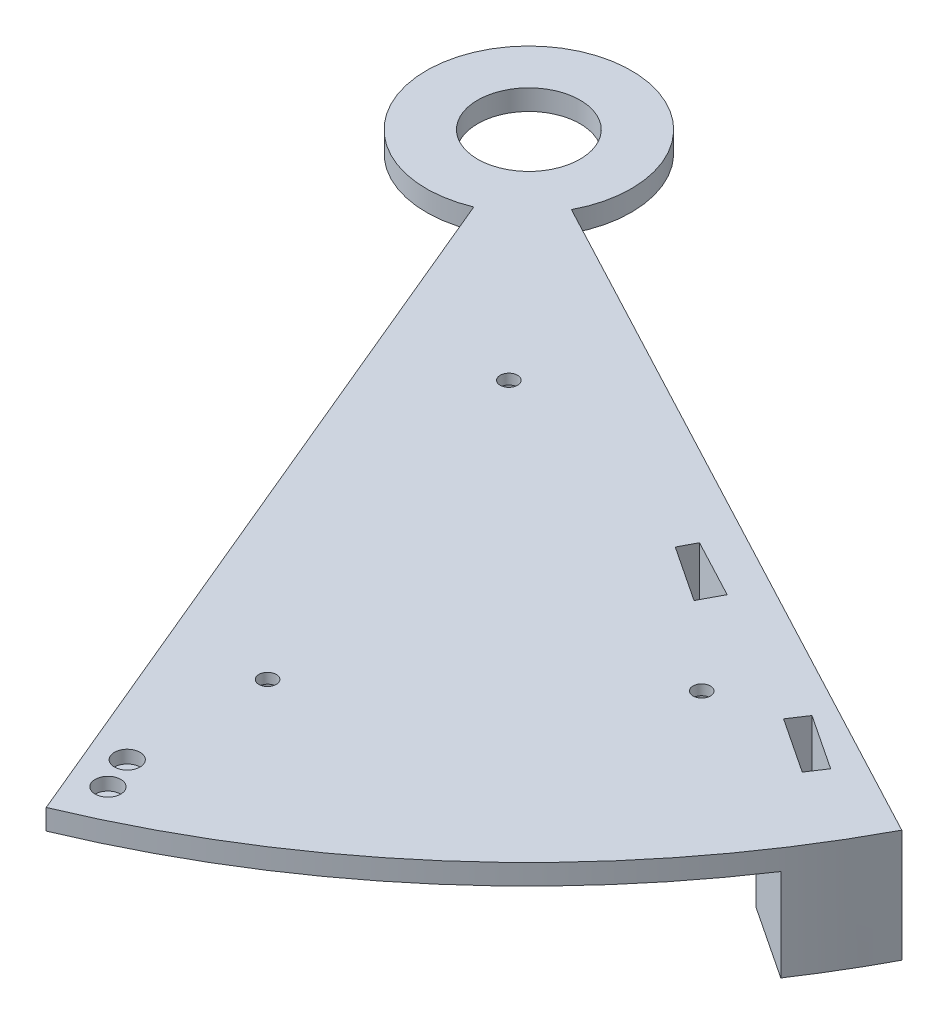
ISO-10303-21;
HEADER;
FILE_DESCRIPTION(('STEP AP214'),'2;1');
FILE_NAME('part.step','',(''),(''),'','','');
FILE_SCHEMA(('AUTOMOTIVE_DESIGN { 1 0 10303 214 1 1 1 1 }'));
ENDSEC;
DATA;
#1=APPLICATION_CONTEXT('core data for automotive mechanical design processes');
#2=APPLICATION_PROTOCOL_DEFINITION('international standard','automotive_design',2000,#1);
#3=PRODUCT_CONTEXT('',#1,'mechanical');
#4=PRODUCT('Part','Part','',(#3));
#5=PRODUCT_RELATED_PRODUCT_CATEGORY('part','',(#4));
#6=PRODUCT_DEFINITION_FORMATION('','',#4);
#7=PRODUCT_DEFINITION_CONTEXT('part definition',#1,'design');
#8=PRODUCT_DEFINITION('design','',#6,#7);
#9=PRODUCT_DEFINITION_SHAPE('','',#8);
#10=(LENGTH_UNIT() NAMED_UNIT(*) SI_UNIT(.MILLI.,.METRE.));
#11=(NAMED_UNIT(*) PLANE_ANGLE_UNIT() SI_UNIT($,.RADIAN.));
#12=(NAMED_UNIT(*) SI_UNIT($,.STERADIAN.) SOLID_ANGLE_UNIT());
#13=UNCERTAINTY_MEASURE_WITH_UNIT(LENGTH_MEASURE(1.E-05),#10,'distance_accuracy_value','');
#14=(GEOMETRIC_REPRESENTATION_CONTEXT(3) GLOBAL_UNCERTAINTY_ASSIGNED_CONTEXT((#13)) GLOBAL_UNIT_ASSIGNED_CONTEXT((#10,
#11,#12)) REPRESENTATION_CONTEXT('',''));
#15=CARTESIAN_POINT('',(0.,0.,0.));
#16=DIRECTION('',(0.,0.,1.));
#17=DIRECTION('',(1.,0.,0.));
#18=AXIS2_PLACEMENT_3D('',#15,#16,#17);
#19=CARTESIAN_POINT('',(0.,-18.,0.));
#20=DIRECTION('',(0.,-1.,0.));
#21=DIRECTION('',(0.,0.,-1.));
#22=AXIS2_PLACEMENT_3D('',#19,#20,#21);
#23=PLANE('',#22);
#24=DIRECTION('',(0.833392984477162,0.,0.552680860374456));
#25=VECTOR('',#24,1.);
#26=CARTESIAN_POINT('',(5.80314903393188,-18.,-8.75062633701035));
#27=LINE('',#26,#25);
#28=CARTESIAN_POINT('',(126.70883079196,-18.,71.4303416610689));
#29=VERTEX_POINT('',#28);
#30=CARTESIAN_POINT('',(137.542939590163,-18.,78.6151928459368));
#31=VERTEX_POINT('',#30);
#32=EDGE_CURVE('E204',#29,#31,#27,.T.);
#33=ORIENTED_EDGE('',*,*,#32,.F.);
#34=DIRECTION('',(0.552680860374454,0.,-0.833392984477163));
#35=VECTOR('',#34,1.);
#36=CARTESIAN_POINT('',(120.905681758028,-18.,80.1809679980791));
#37=LINE('',#36,#35);
#38=CARTESIAN_POINT('',(120.905681758028,-18.,80.1809679980791));
#39=VERTEX_POINT('',#38);
#40=EDGE_CURVE('E187',#39,#29,#37,.T.);
#41=ORIENTED_EDGE('',*,*,#40,.F.);
#42=DIRECTION('',(0.833392984477163,0.,0.552680860374455));
#43=VECTOR('',#42,1.);
#44=CARTESIAN_POINT('',(0.,-18.,0.));
#45=LINE('',#44,#43);
#46=CARTESIAN_POINT('',(95.7592429864337,-18.,63.5046152155351));
#47=VERTEX_POINT('',#46);
#48=EDGE_CURVE('E369',#47,#39,#45,.T.);
#49=ORIENTED_EDGE('',*,*,#48,.F.);
#50=DIRECTION('',(-0.468176170110818,0.,0.883635147411174));
#51=VECTOR('',#50,1.);
#52=CARTESIAN_POINT('',(101.041540999482,-18.,53.5348122195286));
#53=LINE('',#52,#51);
#54=CARTESIAN_POINT('',(101.041540999482,-18.,53.5348122195284));
#55=VERTEX_POINT('',#54);
#56=EDGE_CURVE('E264',#55,#47,#53,.T.);
#57=ORIENTED_EDGE('',*,*,#56,.F.);
#58=DIRECTION('',(0.883635147411175,0.,0.468176170110816));
#59=VECTOR('',#58,1.);
#60=CARTESIAN_POINT('',(0.,-18.,0.));
#61=LINE('',#60,#59);
#62=CARTESIAN_POINT('',(154.857059583808,-18.,82.0478738119205));
#63=VERTEX_POINT('',#62);
#64=EDGE_CURVE('E353',#55,#63,#61,.T.);
#65=ORIENTED_EDGE('',*,*,#64,.T.);
#66=CARTESIAN_POINT('',(0.,-18.,0.));
#67=DIRECTION('',(0.,-1.,0.));
#68=DIRECTION('',(0.,0.,-1.));
#69=AXIS2_PLACEMENT_3D('',#66,#67,#68);
#70=CIRCLE('',#69,175.25);
#71=CARTESIAN_POINT('',(146.052120529623,-18.,96.8573207806232));
#72=VERTEX_POINT('',#71);
#73=EDGE_CURVE('E359',#63,#72,#70,.T.);
#74=ORIENTED_EDGE('',*,*,#73,.T.);
#75=CARTESIAN_POINT('',(131.739790556231,-18.,87.3658191829471));
#76=VERTEX_POINT('',#75);
#77=EDGE_CURVE('E363',#76,#72,#45,.T.);
#78=ORIENTED_EDGE('',*,*,#77,.F.);
#79=DIRECTION('',(0.552680860374456,0.,-0.833392984477162));
#80=VECTOR('',#79,1.);
#81=CARTESIAN_POINT('',(131.739790556231,-18.,87.3658191829473));
#82=LINE('',#81,#80);
#83=EDGE_CURVE('E216',#76,#31,#82,.T.);
#84=ORIENTED_EDGE('',*,*,#83,.T.);
#85=EDGE_LOOP('',(#33,#41,#49,#57,#65,#74,#78,#84));
#86=FACE_BOUND('',#85,.T.);
#87=ADVANCED_FACE('F40',(#86),#23,.T.);
#88=CARTESIAN_POINT('',(-3.04314510572033,4.,5.7436284581727));
#89=DIRECTION('',(0.468176170110815,0.,-0.883635147411175));
#90=DIRECTION('',(-0.883635147411175,0.,-0.468176170110815));
#91=AXIS2_PLACEMENT_3D('',#88,#89,#90);
#92=PLANE('',#91);
#93=DIRECTION('',(0.883635147411175,0.,0.468176170110815));
#94=VECTOR('',#93,1.);
#95=CARTESIAN_POINT('',(-3.04314510572033,-12.,5.7436284581727));
#96=LINE('',#95,#94);
#97=CARTESIAN_POINT('',(86.5111389774166,-12.,53.1921504662605));
#98=VERTEX_POINT('',#97);
#99=CARTESIAN_POINT('',(97.9983958937618,-12.,59.278440677701));
#100=VERTEX_POINT('',#99);
#101=EDGE_CURVE('E242',#98,#100,#96,.T.);
#102=ORIENTED_EDGE('',*,*,#101,.T.);
#103=DIRECTION('',(0.,-1.,0.));
#104=VECTOR('',#103,1.);
#105=CARTESIAN_POINT('',(97.9983958937618,4.,59.278440677701));
#106=LINE('',#105,#104);
#107=CARTESIAN_POINT('',(97.9983958937618,4.,59.278440677701));
#108=VERTEX_POINT('',#107);
#109=EDGE_CURVE('E290',#108,#100,#106,.T.);
#110=ORIENTED_EDGE('',*,*,#109,.F.);
#111=DIRECTION('',(0.883635147411175,0.,0.468176170110815));
#112=VECTOR('',#111,1.);
#113=CARTESIAN_POINT('',(-3.04314510572033,4.,5.7436284581727));
#114=LINE('',#113,#112);
#115=CARTESIAN_POINT('',(86.5111389774166,4.,53.1921504662605));
#116=VERTEX_POINT('',#115);
#117=EDGE_CURVE('E281',#116,#108,#114,.T.);
#118=ORIENTED_EDGE('',*,*,#117,.F.);
#119=DIRECTION('',(0.,-1.,0.));
#120=VECTOR('',#119,1.);
#121=CARTESIAN_POINT('',(86.5111389774166,4.,53.1921504662605));
#122=LINE('',#121,#120);
#123=EDGE_CURVE('E295',#116,#98,#122,.T.);
#124=ORIENTED_EDGE('',*,*,#123,.T.);
#125=EDGE_LOOP('',(#102,#110,#118,#124));
#126=FACE_BOUND('',#125,.T.);
#127=ADVANCED_FACE('F487',(#126),#92,.F.);
#128=CARTESIAN_POINT('',(0.,-18.,0.));
#129=DIRECTION('',(-0.552680860374455,0.,0.833392984477163));
#130=DIRECTION('',(0.833392984477163,0.,0.552680860374455));
#131=AXIS2_PLACEMENT_3D('',#128,#129,#130);
#132=PLANE('',#131);
#133=DIRECTION('',(0.,-1.,0.));
#134=VECTOR('',#133,1.);
#135=CARTESIAN_POINT('',(120.905681758028,-12.,80.1809679980791));
#136=LINE('',#135,#134);
#137=CARTESIAN_POINT('',(120.905681758028,-12.,80.1809679980791));
#138=VERTEX_POINT('',#137);
#139=EDGE_CURVE('E239',#138,#39,#136,.T.);
#140=ORIENTED_EDGE('',*,*,#139,.F.);
#141=DIRECTION('',(-0.833392984477163,0.,-0.552680860374455));
#142=VECTOR('',#141,1.);
#143=CARTESIAN_POINT('',(0.,-12.,0.));
#144=LINE('',#143,#142);
#145=CARTESIAN_POINT('',(131.739790556231,-12.,87.365819182947));
#146=VERTEX_POINT('',#145);
#147=EDGE_CURVE('E227',#146,#138,#144,.T.);
#148=ORIENTED_EDGE('',*,*,#147,.F.);
#149=DIRECTION('',(0.,-1.,0.));
#150=VECTOR('',#149,1.);
#151=CARTESIAN_POINT('',(131.739790556231,-12.,87.3658191829471));
#152=LINE('',#151,#150);
#153=EDGE_CURVE('E234',#146,#76,#152,.T.);
#154=ORIENTED_EDGE('',*,*,#153,.T.);
#155=ORIENTED_EDGE('',*,*,#77,.T.);
#156=DIRECTION('',(0.,1.,0.));
#157=VECTOR('',#156,1.);
#158=CARTESIAN_POINT('',(146.052120529623,-18.,96.8573207806232));
#159=LINE('',#158,#157);
#160=CARTESIAN_POINT('',(146.052120529623,0.,96.8573207806232));
#161=VERTEX_POINT('',#160);
#162=EDGE_CURVE('E379',#72,#161,#159,.T.);
#163=ORIENTED_EDGE('',*,*,#162,.T.);
#164=DIRECTION('',(0.833392984477163,0.,0.552680860374455));
#165=VECTOR('',#164,1.);
#166=CARTESIAN_POINT('',(0.,0.,0.));
#167=LINE('',#166,#165);
#168=CARTESIAN_POINT('',(95.7592429864337,0.,63.5046152155351));
#169=VERTEX_POINT('',#168);
#170=EDGE_CURVE('E373',#169,#161,#167,.T.);
#171=ORIENTED_EDGE('',*,*,#170,.F.);
#172=DIRECTION('',(0.,-1.,0.));
#173=VECTOR('',#172,1.);
#174=CARTESIAN_POINT('',(95.7592429864337,4.,63.5046152155351));
#175=LINE('',#174,#173);
#176=EDGE_CURVE('E285',#169,#47,#175,.T.);
#177=ORIENTED_EDGE('',*,*,#176,.T.);
#178=ORIENTED_EDGE('',*,*,#48,.T.);
#179=EDGE_LOOP('',(#140,#148,#154,#155,#163,#171,#177,#178));
#180=FACE_BOUND('',#179,.T.);
#181=ADVANCED_FACE('F476',(#180),#132,.T.);
#182=CARTESIAN_POINT('',(67.4644149722506,10.,118.480178563555));
#183=DIRECTION('',(0.,-1.,0.));
#184=DIRECTION('',(0.,0.,-1.));
#185=AXIS2_PLACEMENT_3D('',#182,#183,#184);
#186=CYLINDRICAL_SURFACE('',#185,1.7);
#187=CARTESIAN_POINT('',(67.4644149722506,4.,118.480178563555));
#188=DIRECTION('',(0.,1.,0.));
#189=DIRECTION('',(0.,0.,1.));
#190=AXIS2_PLACEMENT_3D('',#187,#188,#189);
#191=CIRCLE('',#190,1.7);
#192=CARTESIAN_POINT('',(67.4644149722506,4.,120.180178563555));
#193=VERTEX_POINT('',#192);
#194=EDGE_CURVE('E336',#193,#193,#191,.T.);
#195=ORIENTED_EDGE('',*,*,#194,.T.);
#196=EDGE_LOOP('',(#195));
#197=FACE_BOUND('',#196,.T.);
#198=CARTESIAN_POINT('',(67.4644149722506,2.,118.480178563555));
#199=DIRECTION('',(0.,-1.,0.));
#200=DIRECTION('',(0.,0.,-1.));
#201=AXIS2_PLACEMENT_3D('',#198,#199,#200);
#202=CIRCLE('',#201,1.7);
#203=CARTESIAN_POINT('',(67.4644149722506,2.,116.780178563555));
#204=VERTEX_POINT('',#203);
#205=EDGE_CURVE('E44',#204,#204,#202,.F.);
#206=ORIENTED_EDGE('',*,*,#205,.F.);
#207=EDGE_LOOP('',(#206));
#208=FACE_BOUND('',#207,.T.);
#209=ADVANCED_FACE('F473',(#197,#208),#186,.F.);
#210=CARTESIAN_POINT('',(111.793635370719,10.,78.0460318696525));
#211=DIRECTION('',(0.,-1.,0.));
#212=DIRECTION('',(0.,0.,-1.));
#213=AXIS2_PLACEMENT_3D('',#210,#211,#212);
#214=CYLINDRICAL_SURFACE('',#213,1.7);
#215=CARTESIAN_POINT('',(111.793635370719,4.,78.0460318696525));
#216=DIRECTION('',(0.,1.,0.));
#217=DIRECTION('',(0.,0.,1.));
#218=AXIS2_PLACEMENT_3D('',#215,#216,#217);
#219=CIRCLE('',#218,1.7);
#220=CARTESIAN_POINT('',(111.793635370719,4.,79.7460318696525));
#221=VERTEX_POINT('',#220);
#222=EDGE_CURVE('E340',#221,#221,#219,.T.);
#223=ORIENTED_EDGE('',*,*,#222,.T.);
#224=EDGE_LOOP('',(#223));
#225=FACE_BOUND('',#224,.T.);
#226=CARTESIAN_POINT('',(111.793635370719,2.,78.0460318696525));
#227=DIRECTION('',(0.,-1.,0.));
#228=DIRECTION('',(0.,0.,-1.));
#229=AXIS2_PLACEMENT_3D('',#226,#227,#228);
#230=CIRCLE('',#229,1.7);
#231=CARTESIAN_POINT('',(111.793635370719,2.,76.3460318696525));
#232=VERTEX_POINT('',#231);
#233=EDGE_CURVE('E462',#232,#232,#230,.F.);
#234=ORIENTED_EDGE('',*,*,#233,.F.);
#235=EDGE_LOOP('',(#234));
#236=FACE_BOUND('',#235,.T.);
#237=ADVANCED_FACE('F475',(#225,#236),#214,.F.);
#238=CARTESIAN_POINT('',(40.4341466939028,10.,44.3292203984679));
#239=DIRECTION('',(0.,-1.,0.));
#240=DIRECTION('',(0.,0.,-1.));
#241=AXIS2_PLACEMENT_3D('',#238,#239,#240);
#242=CYLINDRICAL_SURFACE('',#241,1.7);
#243=CARTESIAN_POINT('',(40.4341466939028,4.,44.3292203984679));
#244=DIRECTION('',(0.,1.,0.));
#245=DIRECTION('',(0.,0.,1.));
#246=AXIS2_PLACEMENT_3D('',#243,#244,#245);
#247=CIRCLE('',#246,1.7);
#248=CARTESIAN_POINT('',(40.4341466939028,4.,46.0292203984679));
#249=VERTEX_POINT('',#248);
#250=EDGE_CURVE('E344',#249,#249,#247,.T.);
#251=ORIENTED_EDGE('',*,*,#250,.T.);
#252=EDGE_LOOP('',(#251));
#253=FACE_BOUND('',#252,.T.);
#254=CARTESIAN_POINT('',(40.4341466939028,2.,44.3292203984679));
#255=DIRECTION('',(0.,-1.,0.));
#256=DIRECTION('',(0.,0.,-1.));
#257=AXIS2_PLACEMENT_3D('',#254,#255,#256);
#258=CIRCLE('',#257,1.7);
#259=CARTESIAN_POINT('',(40.4341466939028,2.,42.629220398468));
#260=VERTEX_POINT('',#259);
#261=EDGE_CURVE('E316',#260,#260,#258,.F.);
#262=ORIENTED_EDGE('',*,*,#261,.F.);
#263=EDGE_LOOP('',(#262));
#264=FACE_BOUND('',#263,.T.);
#265=ADVANCED_FACE('F483',(#253,#264),#242,.F.);
#266=CARTESIAN_POINT('',(0.,4.,0.));
#267=DIRECTION('',(0.,-1.,0.));
#268=DIRECTION('',(0.,0.,-1.));
#269=AXIS2_PLACEMENT_3D('',#266,#267,#268);
#270=CYLINDRICAL_SURFACE('',#269,175.25);
#271=CARTESIAN_POINT('',(0.,0.,0.));
#272=DIRECTION('',(0.,1.,0.));
#273=DIRECTION('',(0.,0.,1.));
#274=AXIS2_PLACEMENT_3D('',#271,#272,#273);
#275=CIRCLE('',#274,175.25);
#276=CARTESIAN_POINT('',(67.5000025728551,0.,161.729132046965));
#277=VERTEX_POINT('',#276);
#278=EDGE_CURVE('E407',#277,#161,#275,.T.);
#279=ORIENTED_EDGE('',*,*,#278,.T.);
#280=ORIENTED_EDGE('',*,*,#162,.F.);
#281=ORIENTED_EDGE('',*,*,#73,.F.);
#282=DIRECTION('',(0.,-1.,0.));
#283=VECTOR('',#282,1.);
#284=CARTESIAN_POINT('',(154.857059583808,4.,82.0478738119205));
#285=LINE('',#284,#283);
#286=CARTESIAN_POINT('',(154.857059583808,4.,82.0478738119205));
#287=VERTEX_POINT('',#286);
#288=EDGE_CURVE('E11',#287,#63,#285,.T.);
#289=ORIENTED_EDGE('',*,*,#288,.F.);
#290=CARTESIAN_POINT('',(0.,4.,0.));
#291=DIRECTION('',(0.,1.,0.));
#292=DIRECTION('',(0.,0.,1.));
#293=AXIS2_PLACEMENT_3D('',#290,#291,#292);
#294=CIRCLE('',#293,175.25);
#295=CARTESIAN_POINT('',(67.5000025728551,4.,161.729132046965));
#296=VERTEX_POINT('',#295);
#297=EDGE_CURVE('E421',#296,#287,#294,.T.);
#298=ORIENTED_EDGE('',*,*,#297,.F.);
#299=DIRECTION('',(0.,-1.,0.));
#300=VECTOR('',#299,1.);
#301=CARTESIAN_POINT('',(67.5000025728551,4.,161.729132046965));
#302=LINE('',#301,#300);
#303=EDGE_CURVE('E435',#296,#277,#302,.T.);
#304=ORIENTED_EDGE('',*,*,#303,.T.);
#305=EDGE_LOOP('',(#279,#280,#281,#289,#298,#304));
#306=FACE_BOUND('',#305,.T.);
#307=ADVANCED_FACE('F42',(#306),#270,.T.);
#308=CARTESIAN_POINT('',(17.6727029482235,4.,9.36352340221632));
#309=DIRECTION('',(-0.468176170110816,0.,0.883635147411175));
#310=DIRECTION('',(0.883635147411175,0.,0.468176170110816));
#311=AXIS2_PLACEMENT_3D('',#308,#309,#310);
#312=PLANE('',#311);
#313=ORIENTED_EDGE('',*,*,#64,.F.);
#314=DIRECTION('',(0.,-1.,0.));
#315=VECTOR('',#314,1.);
#316=CARTESIAN_POINT('',(101.041540999482,-12.,53.5348122195284));
#317=LINE('',#316,#315);
#318=CARTESIAN_POINT('',(101.041540999482,-12.,53.5348122195284));
#319=VERTEX_POINT('',#318);
#320=EDGE_CURVE('E260',#319,#55,#317,.T.);
#321=ORIENTED_EDGE('',*,*,#320,.F.);
#322=DIRECTION('',(0.883635147411175,0.,0.468176170110816));
#323=VECTOR('',#322,1.);
#324=CARTESIAN_POINT('',(0.,-12.,0.));
#325=LINE('',#324,#323);
#326=CARTESIAN_POINT('',(89.5542840831369,-12.,47.4485220080878));
#327=VERTEX_POINT('',#326);
#328=EDGE_CURVE('E253',#327,#319,#325,.T.);
#329=ORIENTED_EDGE('',*,*,#328,.F.);
#330=DIRECTION('',(0.,-1.,0.));
#331=VECTOR('',#330,1.);
#332=CARTESIAN_POINT('',(89.5542840831369,-12.,47.4485220080878));
#333=LINE('',#332,#331);
#334=CARTESIAN_POINT('',(89.5542840831369,-18.,47.4485220080878));
#335=VERTEX_POINT('',#334);
#336=EDGE_CURVE('E259',#327,#335,#333,.T.);
#337=ORIENTED_EDGE('',*,*,#336,.T.);
#338=CARTESIAN_POINT('',(17.6727029482235,-18.,9.36352340221632));
#339=VERTEX_POINT('',#338);
#340=EDGE_CURVE('E355',#339,#335,#61,.T.);
#341=ORIENTED_EDGE('',*,*,#340,.F.);
#342=DIRECTION('',(0.,1.,0.));
#343=VECTOR('',#342,1.);
#344=CARTESIAN_POINT('',(17.6727029482235,-18.,9.36352340221632));
#345=LINE('',#344,#343);
#346=CARTESIAN_POINT('',(17.6727029482235,0.,9.36352340221632));
#347=VERTEX_POINT('',#346);
#348=EDGE_CURVE('E383',#339,#347,#345,.T.);
#349=ORIENTED_EDGE('',*,*,#348,.T.);
#350=DIRECTION('',(0.,-1.,0.));
#351=VECTOR('',#350,1.);
#352=CARTESIAN_POINT('',(17.6727029482235,4.,9.36352340221632));
#353=LINE('',#352,#351);
#354=CARTESIAN_POINT('',(17.6727029482235,4.,9.36352340221632));
#355=VERTEX_POINT('',#354);
#356=EDGE_CURVE('E50',#355,#347,#353,.T.);
#357=ORIENTED_EDGE('',*,*,#356,.F.);
#358=DIRECTION('',(-0.883635147411175,0.,-0.468176170110816));
#359=VECTOR('',#358,1.);
#360=CARTESIAN_POINT('',(17.6727029482235,4.,9.36352340221632));
#361=LINE('',#360,#359);
#362=EDGE_CURVE('E425',#287,#355,#361,.T.);
#363=ORIENTED_EDGE('',*,*,#362,.F.);
#364=ORIENTED_EDGE('',*,*,#288,.T.);
#365=EDGE_LOOP('',(#313,#321,#329,#337,#341,#349,#357,#363,#364));
#366=FACE_BOUND('',#365,.T.);
#367=ADVANCED_FACE('F521',(#366),#312,.F.);
#368=CARTESIAN_POINT('',(0.,4.,0.));
#369=DIRECTION('',(0.,-1.,0.));
#370=DIRECTION('',(0.,0.,-1.));
#371=AXIS2_PLACEMENT_3D('',#368,#369,#370);
#372=CYLINDRICAL_SURFACE('',#371,20.);
#373=CARTESIAN_POINT('',(0.,0.,0.));
#374=DIRECTION('',(0.,1.,0.));
#375=DIRECTION('',(0.,0.,1.));
#376=AXIS2_PLACEMENT_3D('',#373,#374,#375);
#377=CIRCLE('',#376,20.);
#378=CARTESIAN_POINT('',(7.70328132072526,0.,18.4569622878134));
#379=VERTEX_POINT('',#378);
#380=EDGE_CURVE('E439',#347,#379,#377,.T.);
#381=ORIENTED_EDGE('',*,*,#380,.T.);
#382=DIRECTION('',(0.,-1.,0.));
#383=VECTOR('',#382,1.);
#384=CARTESIAN_POINT('',(7.70328132072526,4.,18.4569622878134));
#385=LINE('',#384,#383);
#386=CARTESIAN_POINT('',(7.70328132072526,4.,18.4569622878134));
#387=VERTEX_POINT('',#386);
#388=EDGE_CURVE('E447',#387,#379,#385,.T.);
#389=ORIENTED_EDGE('',*,*,#388,.F.);
#390=CARTESIAN_POINT('',(0.,4.,0.));
#391=DIRECTION('',(0.,1.,0.));
#392=DIRECTION('',(0.,0.,1.));
#393=AXIS2_PLACEMENT_3D('',#390,#391,#392);
#394=CIRCLE('',#393,20.);
#395=EDGE_CURVE('E429',#355,#387,#394,.T.);
#396=ORIENTED_EDGE('',*,*,#395,.F.);
#397=ORIENTED_EDGE('',*,*,#356,.T.);
#398=EDGE_LOOP('',(#381,#389,#396,#397));
#399=FACE_BOUND('',#398,.T.);
#400=ADVANCED_FACE('F559',(#399),#372,.T.);
#401=CARTESIAN_POINT('',(67.5000025728551,4.,161.729132046965));
#402=DIRECTION('',(0.922848114390669,0.,-0.385164066036263));
#403=DIRECTION('',(-0.385164066036263,0.,-0.922848114390669));
#404=AXIS2_PLACEMENT_3D('',#401,#402,#403);
#405=PLANE('',#404);
#406=DIRECTION('',(0.385164066036263,0.,0.922848114390669));
#407=VECTOR('',#406,1.);
#408=CARTESIAN_POINT('',(67.5000025728551,0.,161.729132046965));
#409=LINE('',#408,#407);
#410=EDGE_CURVE('E426',#379,#277,#409,.T.);
#411=ORIENTED_EDGE('',*,*,#410,.T.);
#412=ORIENTED_EDGE('',*,*,#303,.F.);
#413=DIRECTION('',(0.385164066036263,0.,0.922848114390669));
#414=VECTOR('',#413,1.);
#415=CARTESIAN_POINT('',(67.5000025728551,4.,161.729132046965));
#416=LINE('',#415,#414);
#417=EDGE_CURVE('E432',#387,#296,#416,.T.);
#418=ORIENTED_EDGE('',*,*,#417,.F.);
#419=ORIENTED_EDGE('',*,*,#388,.T.);
#420=EDGE_LOOP('',(#411,#412,#418,#419));
#421=FACE_BOUND('',#420,.T.);
#422=ADVANCED_FACE('F564',(#421),#405,.F.);
#423=CARTESIAN_POINT('',(0.,4.,0.));
#424=DIRECTION('',(0.,1.,0.));
#425=DIRECTION('',(0.,0.,1.));
#426=AXIS2_PLACEMENT_3D('',#423,#424,#425);
#427=PLANE('',#426);
#428=DIRECTION('',(0.552680860374452,0.,-0.833392984477165));
#429=VECTOR('',#428,1.);
#430=CARTESIAN_POINT('',(120.905681758029,4.,80.1809679980787));
#431=LINE('',#430,#429);
#432=CARTESIAN_POINT('',(124.498107350462,4.,74.7639135989776));
#433=VERTEX_POINT('',#432);
#434=CARTESIAN_POINT('',(126.70883079196,4.,71.4303416610689));
#435=VERTEX_POINT('',#434);
#436=EDGE_CURVE('E184',#433,#435,#431,.T.);
#437=ORIENTED_EDGE('',*,*,#436,.T.);
#438=DIRECTION('',(0.833392984477162,0.,0.552680860374456));
#439=VECTOR('',#438,1.);
#440=CARTESIAN_POINT('',(5.80314903393188,4.,-8.75062633701035));
#441=LINE('',#440,#439);
#442=CARTESIAN_POINT('',(137.542939590163,4.,78.6151928459369));
#443=VERTEX_POINT('',#442);
#444=EDGE_CURVE('E193',#435,#443,#441,.T.);
#445=ORIENTED_EDGE('',*,*,#444,.T.);
#446=DIRECTION('',(0.552680860374449,0.,-0.833392984477167));
#447=VECTOR('',#446,1.);
#448=CARTESIAN_POINT('',(131.739790556232,4.,87.3658191829461));
#449=LINE('',#448,#447);
#450=CARTESIAN_POINT('',(135.332216148665,4.,81.9487647838455));
#451=VERTEX_POINT('',#450);
#452=EDGE_CURVE('E198',#451,#443,#449,.T.);
#453=ORIENTED_EDGE('',*,*,#452,.F.);
#454=DIRECTION('',(-0.833392984477163,0.,-0.552680860374454));
#455=VECTOR('',#454,1.);
#456=CARTESIAN_POINT('',(3.59242559243389,4.,-5.41705439910147));
#457=LINE('',#456,#455);
#458=EDGE_CURVE('E190',#451,#433,#457,.T.);
#459=ORIENTED_EDGE('',*,*,#458,.T.);
#460=EDGE_LOOP('',(#437,#445,#453,#459));
#461=FACE_BOUND('',#460,.T.);
#462=DIRECTION('',(-0.468176170110818,0.,0.883635147411174));
#463=VECTOR('',#462,1.);
#464=CARTESIAN_POINT('',(101.041540999482,4.,53.5348122195286));
#465=LINE('',#464,#463);
#466=CARTESIAN_POINT('',(95.7592429864337,4.,63.5046152155351));
#467=VERTEX_POINT('',#466);
#468=EDGE_CURVE('E268',#108,#467,#465,.T.);
#469=ORIENTED_EDGE('',*,*,#468,.T.);
#470=DIRECTION('',(-0.833392984477163,0.,-0.552680860374455));
#471=VECTOR('',#470,1.);
#472=CARTESIAN_POINT('',(0.,4.,0.));
#473=LINE('',#472,#471);
#474=CARTESIAN_POINT('',(84.8725223820288,4.,56.2848734821996));
#475=VERTEX_POINT('',#474);
#476=EDGE_CURVE('E272',#467,#475,#473,.T.);
#477=ORIENTED_EDGE('',*,*,#476,.T.);
#478=DIRECTION('',(0.468176170110815,0.,-0.883635147411175));
#479=VECTOR('',#478,1.);
#480=CARTESIAN_POINT('',(89.554284083137,4.,47.4485220080877));
#481=LINE('',#480,#479);
#482=EDGE_CURVE('E277',#475,#116,#481,.T.);
#483=ORIENTED_EDGE('',*,*,#482,.T.);
#484=ORIENTED_EDGE('',*,*,#117,.T.);
#485=EDGE_LOOP('',(#469,#477,#483,#484));
#486=FACE_BOUND('',#485,.T.);
#487=ORIENTED_EDGE('',*,*,#250,.F.);
#488=EDGE_LOOP('',(#487));
#489=FACE_BOUND('',#488,.T.);
#490=ORIENTED_EDGE('',*,*,#222,.F.);
#491=EDGE_LOOP('',(#490));
#492=FACE_BOUND('',#491,.T.);
#493=ORIENTED_EDGE('',*,*,#194,.F.);
#494=EDGE_LOOP('',(#493));
#495=FACE_BOUND('',#494,.T.);
#496=CARTESIAN_POINT('',(0.,4.,0.));
#497=DIRECTION('',(0.,1.,0.));
#498=DIRECTION('',(0.,0.,1.));
#499=AXIS2_PLACEMENT_3D('',#496,#497,#498);
#500=CIRCLE('',#499,10.);
#501=CARTESIAN_POINT('',(0.,4.,10.));
#502=VERTEX_POINT('',#501);
#503=EDGE_CURVE('E386',#502,#502,#500,.T.);
#504=ORIENTED_EDGE('',*,*,#503,.F.);
#505=EDGE_LOOP('',(#504));
#506=FACE_BOUND('',#505,.T.);
#507=CARTESIAN_POINT('',(70.0252076744945,4.,152.20421114458));
#508=DIRECTION('',(0.,1.,0.));
#509=DIRECTION('',(0.,0.,-1.));
#510=AXIS2_PLACEMENT_3D('',#507,#508,#509);
#511=CIRCLE('',#510,2.49999999999998);
#512=CARTESIAN_POINT('',(70.0252076744945,4.,149.70421114458));
#513=VERTEX_POINT('',#512);
#514=EDGE_CURVE('E408',#513,#513,#511,.T.);
#515=ORIENTED_EDGE('',*,*,#514,.F.);
#516=EDGE_LOOP('',(#515));
#517=FACE_BOUND('',#516,.T.);
#518=CARTESIAN_POINT('',(67.3271757764404,4.,145.739984225223));
#519=DIRECTION('',(0.,1.,0.));
#520=DIRECTION('',(0.,0.,-1.));
#521=AXIS2_PLACEMENT_3D('',#518,#519,#520);
#522=CIRCLE('',#521,2.50000000000001);
#523=CARTESIAN_POINT('',(67.3271757764404,4.,143.239984225223));
#524=VERTEX_POINT('',#523);
#525=EDGE_CURVE('E416',#524,#524,#522,.T.);
#526=ORIENTED_EDGE('',*,*,#525,.F.);
#527=EDGE_LOOP('',(#526));
#528=FACE_BOUND('',#527,.T.);
#529=ORIENTED_EDGE('',*,*,#297,.T.);
#530=ORIENTED_EDGE('',*,*,#362,.T.);
#531=ORIENTED_EDGE('',*,*,#395,.T.);
#532=ORIENTED_EDGE('',*,*,#417,.T.);
#533=EDGE_LOOP('',(#529,#530,#531,#532));
#534=FACE_BOUND('',#533,.T.);
#535=ADVANCED_FACE('F200',(#461,#486,#489,#492,#495,#506,#517,#528,#534),#427,.T.);
#536=CARTESIAN_POINT('',(0.,0.,0.));
#537=DIRECTION('',(0.,1.,0.));
#538=DIRECTION('',(0.,0.,1.));
#539=AXIS2_PLACEMENT_3D('',#536,#537,#538);
#540=PLANE('',#539);
#541=CARTESIAN_POINT('',(111.793635370719,0.,78.0460318696525));
#542=DIRECTION('',(0.,-1.,0.));
#543=DIRECTION('',(0.,0.,-1.));
#544=AXIS2_PLACEMENT_3D('',#541,#542,#543);
#545=CIRCLE('',#544,3.00000000000001);
#546=CARTESIAN_POINT('',(111.793635370719,0.,75.0460318696525));
#547=VERTEX_POINT('',#546);
#548=EDGE_CURVE('E317',#547,#547,#545,.T.);
#549=ORIENTED_EDGE('',*,*,#548,.F.);
#550=EDGE_LOOP('',(#549));
#551=FACE_BOUND('',#550,.T.);
#552=CARTESIAN_POINT('',(40.4341466939028,0.,44.3292203984679));
#553=DIRECTION('',(0.,-1.,0.));
#554=DIRECTION('',(0.,0.,-1.));
#555=AXIS2_PLACEMENT_3D('',#552,#553,#554);
#556=CIRCLE('',#555,3.);
#557=CARTESIAN_POINT('',(40.4341466939028,0.,41.3292203984679));
#558=VERTEX_POINT('',#557);
#559=EDGE_CURVE('E325',#558,#558,#556,.T.);
#560=ORIENTED_EDGE('',*,*,#559,.F.);
#561=EDGE_LOOP('',(#560));
#562=FACE_BOUND('',#561,.T.);
#563=CARTESIAN_POINT('',(67.4644149722506,0.,118.480178563555));
#564=DIRECTION('',(0.,-1.,0.));
#565=DIRECTION('',(0.,0.,-1.));
#566=AXIS2_PLACEMENT_3D('',#563,#564,#565);
#567=CIRCLE('',#566,3.00000000000001);
#568=CARTESIAN_POINT('',(67.4644149722506,0.,115.480178563555));
#569=VERTEX_POINT('',#568);
#570=EDGE_CURVE('E311',#569,#569,#567,.T.);
#571=ORIENTED_EDGE('',*,*,#570,.F.);
#572=EDGE_LOOP('',(#571));
#573=FACE_BOUND('',#572,.T.);
#574=CARTESIAN_POINT('',(0.,0.,0.));
#575=DIRECTION('',(0.,1.,0.));
#576=DIRECTION('',(0.,0.,1.));
#577=AXIS2_PLACEMENT_3D('',#574,#575,#576);
#578=CIRCLE('',#577,10.);
#579=CARTESIAN_POINT('',(0.,0.,10.));
#580=VERTEX_POINT('',#579);
#581=EDGE_CURVE('E387',#580,#580,#578,.T.);
#582=ORIENTED_EDGE('',*,*,#581,.T.);
#583=EDGE_LOOP('',(#582));
#584=FACE_BOUND('',#583,.T.);
#585=CARTESIAN_POINT('',(70.0252076744945,0.,152.20421114458));
#586=DIRECTION('',(0.,1.,0.));
#587=DIRECTION('',(0.,0.,-1.));
#588=AXIS2_PLACEMENT_3D('',#585,#586,#587);
#589=CIRCLE('',#588,0.750000000000012);
#590=CARTESIAN_POINT('',(70.0252076744945,0.,151.45421114458));
#591=VERTEX_POINT('',#590);
#592=EDGE_CURVE('E395',#591,#591,#589,.T.);
#593=ORIENTED_EDGE('',*,*,#592,.T.);
#594=EDGE_LOOP('',(#593));
#595=FACE_BOUND('',#594,.T.);
#596=CARTESIAN_POINT('',(67.3271757764404,0.,145.739984225223));
#597=DIRECTION('',(0.,1.,0.));
#598=DIRECTION('',(0.,0.,-1.));
#599=AXIS2_PLACEMENT_3D('',#596,#597,#598);
#600=CIRCLE('',#599,0.750000000000012);
#601=CARTESIAN_POINT('',(67.3271757764404,0.,144.989984225223));
#602=VERTEX_POINT('',#601);
#603=EDGE_CURVE('E391',#602,#602,#600,.T.);
#604=ORIENTED_EDGE('',*,*,#603,.T.);
#605=EDGE_LOOP('',(#604));
#606=FACE_BOUND('',#605,.T.);
#607=ORIENTED_EDGE('',*,*,#380,.F.);
#608=CARTESIAN_POINT('',(0.,0.,0.));
#609=DIRECTION('',(0.,-1.,0.));
#610=DIRECTION('',(0.,0.,-1.));
#611=AXIS2_PLACEMENT_3D('',#608,#609,#610);
#612=CIRCLE('',#611,20.);
#613=CARTESIAN_POINT('',(16.6678596895433,0.,11.0536172074891));
#614=VERTEX_POINT('',#613);
#615=EDGE_CURVE('E348',#347,#614,#612,.T.);
#616=ORIENTED_EDGE('',*,*,#615,.T.);
#617=CARTESIAN_POINT('',(84.8725223820288,0.,56.2848734821996));
#618=VERTEX_POINT('',#617);
#619=EDGE_CURVE('E354',#614,#618,#167,.T.);
#620=ORIENTED_EDGE('',*,*,#619,.T.);
#621=DIRECTION('',(0.833392984477163,0.,0.552680860374455));
#622=VECTOR('',#621,1.);
#623=CARTESIAN_POINT('',(0.,0.,0.));
#624=LINE('',#623,#622);
#625=EDGE_CURVE('E294',#618,#169,#624,.T.);
#626=ORIENTED_EDGE('',*,*,#625,.T.);
#627=ORIENTED_EDGE('',*,*,#170,.T.);
#628=ORIENTED_EDGE('',*,*,#278,.F.);
#629=ORIENTED_EDGE('',*,*,#410,.F.);
#630=EDGE_LOOP('',(#607,#616,#620,#626,#627,#628,#629));
#631=FACE_BOUND('',#630,.T.);
#632=ADVANCED_FACE('F552',(#551,#562,#573,#584,#595,#606,#631),#540,.F.);
#633=CARTESIAN_POINT('',(67.3271757764404,1.5,145.739984225223));
#634=DIRECTION('',(0.,1.,0.));
#635=DIRECTION('',(0.,0.,1.));
#636=AXIS2_PLACEMENT_3D('',#633,#634,#635);
#637=CYLINDRICAL_SURFACE('',#636,2.50000000000001);
#638=CARTESIAN_POINT('',(67.3271757764404,1.5,145.739984225223));
#639=DIRECTION('',(0.,1.,0.));
#640=DIRECTION('',(0.,0.,-1.));
#641=AXIS2_PLACEMENT_3D('',#638,#639,#640);
#642=CIRCLE('',#641,2.50000000000001);
#643=CARTESIAN_POINT('',(67.3271757764404,1.5,143.239984225223));
#644=VERTEX_POINT('',#643);
#645=EDGE_CURVE('E412',#644,#644,#642,.T.);
#646=ORIENTED_EDGE('',*,*,#645,.F.);
#647=EDGE_LOOP('',(#646));
#648=FACE_BOUND('',#647,.T.);
#649=ORIENTED_EDGE('',*,*,#525,.T.);
#650=EDGE_LOOP('',(#649));
#651=FACE_BOUND('',#650,.T.);
#652=ADVANCED_FACE('F641',(#648,#651),#637,.F.);
#653=CARTESIAN_POINT('',(67.3271757764404,1.5,145.739984225223));
#654=DIRECTION('',(0.,-1.,0.));
#655=DIRECTION('',(0.,0.,-1.));
#656=AXIS2_PLACEMENT_3D('',#653,#654,#655);
#657=PLANE('',#656);
#658=CARTESIAN_POINT('',(67.3271757764404,1.5,145.739984225223));
#659=DIRECTION('',(0.,-1.,0.));
#660=DIRECTION('',(0.,0.,-1.));
#661=AXIS2_PLACEMENT_3D('',#658,#659,#660);
#662=CIRCLE('',#661,0.750000000000012);
#663=CARTESIAN_POINT('',(67.3271757764404,1.5,144.989984225223));
#664=VERTEX_POINT('',#663);
#665=EDGE_CURVE('E420',#664,#664,#662,.T.);
#666=ORIENTED_EDGE('',*,*,#665,.T.);
#667=EDGE_LOOP('',(#666));
#668=FACE_BOUND('',#667,.T.);
#669=ORIENTED_EDGE('',*,*,#645,.T.);
#670=EDGE_LOOP('',(#669));
#671=FACE_BOUND('',#670,.T.);
#672=ADVANCED_FACE('F643',(#668,#671),#657,.F.);
#673=CARTESIAN_POINT('',(70.0252076744945,1.5,152.20421114458));
#674=DIRECTION('',(0.,1.,0.));
#675=DIRECTION('',(0.,0.,1.));
#676=AXIS2_PLACEMENT_3D('',#673,#674,#675);
#677=CYLINDRICAL_SURFACE('',#676,2.49999999999998);
#678=CARTESIAN_POINT('',(70.0252076744945,1.5,152.20421114458));
#679=DIRECTION('',(0.,1.,0.));
#680=DIRECTION('',(0.,0.,-1.));
#681=AXIS2_PLACEMENT_3D('',#678,#679,#680);
#682=CIRCLE('',#681,2.49999999999998);
#683=CARTESIAN_POINT('',(70.0252076744945,1.5,149.70421114458));
#684=VERTEX_POINT('',#683);
#685=EDGE_CURVE('E403',#684,#684,#682,.T.);
#686=ORIENTED_EDGE('',*,*,#685,.F.);
#687=EDGE_LOOP('',(#686));
#688=FACE_BOUND('',#687,.T.);
#689=ORIENTED_EDGE('',*,*,#514,.T.);
#690=EDGE_LOOP('',(#689));
#691=FACE_BOUND('',#690,.T.);
#692=ADVANCED_FACE('F650',(#688,#691),#677,.F.);
#693=CARTESIAN_POINT('',(70.0252076744945,1.5,152.20421114458));
#694=DIRECTION('',(0.,-1.,0.));
#695=DIRECTION('',(0.,0.,-1.));
#696=AXIS2_PLACEMENT_3D('',#693,#694,#695);
#697=PLANE('',#696);
#698=CARTESIAN_POINT('',(70.0252076744945,1.5,152.20421114458));
#699=DIRECTION('',(0.,-1.,0.));
#700=DIRECTION('',(0.,0.,-1.));
#701=AXIS2_PLACEMENT_3D('',#698,#699,#700);
#702=CIRCLE('',#701,0.750000000000012);
#703=CARTESIAN_POINT('',(70.0252076744945,1.5,151.45421114458));
#704=VERTEX_POINT('',#703);
#705=EDGE_CURVE('E399',#704,#704,#702,.T.);
#706=ORIENTED_EDGE('',*,*,#705,.T.);
#707=EDGE_LOOP('',(#706));
#708=FACE_BOUND('',#707,.T.);
#709=ORIENTED_EDGE('',*,*,#685,.T.);
#710=EDGE_LOOP('',(#709));
#711=FACE_BOUND('',#710,.T.);
#712=ADVANCED_FACE('F788',(#708,#711),#697,.F.);
#713=CARTESIAN_POINT('',(70.0252076744945,0.,152.20421114458));
#714=DIRECTION('',(0.,1.,0.));
#715=DIRECTION('',(0.,0.,1.));
#716=AXIS2_PLACEMENT_3D('',#713,#714,#715);
#717=CYLINDRICAL_SURFACE('',#716,0.750000000000012);
#718=ORIENTED_EDGE('',*,*,#592,.F.);
#719=EDGE_LOOP('',(#718));
#720=FACE_BOUND('',#719,.T.);
#721=ORIENTED_EDGE('',*,*,#705,.F.);
#722=EDGE_LOOP('',(#721));
#723=FACE_BOUND('',#722,.T.);
#724=ADVANCED_FACE('F778',(#720,#723),#717,.F.);
#725=CARTESIAN_POINT('',(67.3271757764404,0.,145.739984225223));
#726=DIRECTION('',(0.,1.,0.));
#727=DIRECTION('',(0.,0.,1.));
#728=AXIS2_PLACEMENT_3D('',#725,#726,#727);
#729=CYLINDRICAL_SURFACE('',#728,0.750000000000012);
#730=ORIENTED_EDGE('',*,*,#603,.F.);
#731=EDGE_LOOP('',(#730));
#732=FACE_BOUND('',#731,.T.);
#733=ORIENTED_EDGE('',*,*,#665,.F.);
#734=EDGE_LOOP('',(#733));
#735=FACE_BOUND('',#734,.T.);
#736=ADVANCED_FACE('F768',(#732,#735),#729,.F.);
#737=CARTESIAN_POINT('',(0.,0.,0.));
#738=DIRECTION('',(0.,1.,0.));
#739=DIRECTION('',(0.,0.,1.));
#740=AXIS2_PLACEMENT_3D('',#737,#738,#739);
#741=CYLINDRICAL_SURFACE('',#740,10.);
#742=ORIENTED_EDGE('',*,*,#581,.F.);
#743=EDGE_LOOP('',(#742));
#744=FACE_BOUND('',#743,.T.);
#745=ORIENTED_EDGE('',*,*,#503,.T.);
#746=EDGE_LOOP('',(#745));
#747=FACE_BOUND('',#746,.T.);
#748=ADVANCED_FACE('F746',(#744,#747),#741,.F.);
#749=CARTESIAN_POINT('',(0.,-18.,0.));
#750=DIRECTION('',(0.,1.,0.));
#751=DIRECTION('',(0.,0.,1.));
#752=AXIS2_PLACEMENT_3D('',#749,#750,#751);
#753=CYLINDRICAL_SURFACE('',#752,20.);
#754=ORIENTED_EDGE('',*,*,#615,.F.);
#755=ORIENTED_EDGE('',*,*,#348,.F.);
#756=CARTESIAN_POINT('',(0.,-18.,0.));
#757=DIRECTION('',(0.,-1.,0.));
#758=DIRECTION('',(0.,0.,-1.));
#759=AXIS2_PLACEMENT_3D('',#756,#757,#758);
#760=CIRCLE('',#759,20.);
#761=CARTESIAN_POINT('',(16.6678596895433,-18.,11.0536172074891));
#762=VERTEX_POINT('',#761);
#763=EDGE_CURVE('E349',#339,#762,#760,.T.);
#764=ORIENTED_EDGE('',*,*,#763,.T.);
#765=DIRECTION('',(0.,1.,0.));
#766=VECTOR('',#765,1.);
#767=CARTESIAN_POINT('',(16.6678596895433,-18.,11.0536172074891));
#768=LINE('',#767,#766);
#769=EDGE_CURVE('E368',#762,#614,#768,.T.);
#770=ORIENTED_EDGE('',*,*,#769,.T.);
#771=EDGE_LOOP('',(#754,#755,#764,#770));
#772=FACE_BOUND('',#771,.T.);
#773=ADVANCED_FACE('F513',(#772),#753,.F.);
#774=DIRECTION('',(0.,-1.,0.));
#775=VECTOR('',#774,1.);
#776=CARTESIAN_POINT('',(84.8725223820288,4.,56.2848734821996));
#777=LINE('',#776,#775);
#778=CARTESIAN_POINT('',(84.8725223820288,-18.,56.2848734821996));
#779=VERTEX_POINT('',#778);
#780=EDGE_CURVE('E303',#618,#779,#777,.T.);
#781=ORIENTED_EDGE('',*,*,#780,.F.);
#782=ORIENTED_EDGE('',*,*,#619,.F.);
#783=ORIENTED_EDGE('',*,*,#769,.F.);
#784=EDGE_CURVE('E364',#762,#779,#45,.T.);
#785=ORIENTED_EDGE('',*,*,#784,.T.);
#786=EDGE_LOOP('',(#781,#782,#783,#785));
#787=FACE_BOUND('',#786,.T.);
#788=ADVANCED_FACE('F490',(#787),#132,.T.);
#789=ORIENTED_EDGE('',*,*,#340,.T.);
#790=DIRECTION('',(0.468176170110815,0.,-0.883635147411175));
#791=VECTOR('',#790,1.);
#792=CARTESIAN_POINT('',(89.554284083137,-18.,47.4485220080877));
#793=LINE('',#792,#791);
#794=EDGE_CURVE('E273',#779,#335,#793,.T.);
#795=ORIENTED_EDGE('',*,*,#794,.F.);
#796=ORIENTED_EDGE('',*,*,#784,.F.);
#797=ORIENTED_EDGE('',*,*,#763,.F.);
#798=EDGE_LOOP('',(#789,#795,#796,#797));
#799=FACE_BOUND('',#798,.T.);
#800=ADVANCED_FACE('F494',(#799),#23,.T.);
#801=CARTESIAN_POINT('',(40.4341466939028,2.,44.3292203984679));
#802=DIRECTION('',(0.,-1.,0.));
#803=DIRECTION('',(0.,0.,-1.));
#804=AXIS2_PLACEMENT_3D('',#801,#802,#803);
#805=PLANE('',#804);
#806=CARTESIAN_POINT('',(40.4341466939028,2.,44.3292203984679));
#807=DIRECTION('',(0.,-1.,0.));
#808=DIRECTION('',(0.,0.,-1.));
#809=AXIS2_PLACEMENT_3D('',#806,#807,#808);
#810=CIRCLE('',#809,3.);
#811=CARTESIAN_POINT('',(40.4341466939028,2.,41.3292203984679));
#812=VERTEX_POINT('',#811);
#813=EDGE_CURVE('E321',#812,#812,#810,.T.);
#814=ORIENTED_EDGE('',*,*,#813,.T.);
#815=EDGE_LOOP('',(#814));
#816=FACE_BOUND('',#815,.T.);
#817=ORIENTED_EDGE('',*,*,#261,.T.);
#818=EDGE_LOOP('',(#817));
#819=FACE_BOUND('',#818,.T.);
#820=ADVANCED_FACE('F502',(#816,#819),#805,.T.);
#821=CARTESIAN_POINT('',(40.4341466939028,2.,44.3292203984679));
#822=DIRECTION('',(0.,-1.,0.));
#823=DIRECTION('',(0.,0.,-1.));
#824=AXIS2_PLACEMENT_3D('',#821,#822,#823);
#825=CYLINDRICAL_SURFACE('',#824,3.);
#826=ORIENTED_EDGE('',*,*,#813,.F.);
#827=EDGE_LOOP('',(#826));
#828=FACE_BOUND('',#827,.T.);
#829=ORIENTED_EDGE('',*,*,#559,.T.);
#830=EDGE_LOOP('',(#829));
#831=FACE_BOUND('',#830,.T.);
#832=ADVANCED_FACE('F509',(#828,#831),#825,.F.);
#833=CARTESIAN_POINT('',(111.793635370719,2.,78.0460318696525));
#834=DIRECTION('',(0.,-1.,0.));
#835=DIRECTION('',(0.,0.,-1.));
#836=AXIS2_PLACEMENT_3D('',#833,#834,#835);
#837=PLANE('',#836);
#838=CARTESIAN_POINT('',(111.793635370719,2.,78.0460318696525));
#839=DIRECTION('',(0.,-1.,0.));
#840=DIRECTION('',(0.,0.,-1.));
#841=AXIS2_PLACEMENT_3D('',#838,#839,#840);
#842=CIRCLE('',#841,3.00000000000001);
#843=CARTESIAN_POINT('',(111.793635370719,2.,75.0460318696525));
#844=VERTEX_POINT('',#843);
#845=EDGE_CURVE('E312',#844,#844,#842,.T.);
#846=ORIENTED_EDGE('',*,*,#845,.T.);
#847=EDGE_LOOP('',(#846));
#848=FACE_BOUND('',#847,.T.);
#849=ORIENTED_EDGE('',*,*,#233,.T.);
#850=EDGE_LOOP('',(#849));
#851=FACE_BOUND('',#850,.T.);
#852=ADVANCED_FACE('F603',(#848,#851),#837,.T.);
#853=CARTESIAN_POINT('',(111.793635370719,2.,78.0460318696525));
#854=DIRECTION('',(0.,-1.,0.));
#855=DIRECTION('',(0.,0.,-1.));
#856=AXIS2_PLACEMENT_3D('',#853,#854,#855);
#857=CYLINDRICAL_SURFACE('',#856,3.00000000000001);
#858=ORIENTED_EDGE('',*,*,#845,.F.);
#859=EDGE_LOOP('',(#858));
#860=FACE_BOUND('',#859,.T.);
#861=ORIENTED_EDGE('',*,*,#548,.T.);
#862=EDGE_LOOP('',(#861));
#863=FACE_BOUND('',#862,.T.);
#864=ADVANCED_FACE('F606',(#860,#863),#857,.F.);
#865=CARTESIAN_POINT('',(67.4644149722506,2.,118.480178563555));
#866=DIRECTION('',(0.,-1.,0.));
#867=DIRECTION('',(0.,0.,-1.));
#868=AXIS2_PLACEMENT_3D('',#865,#866,#867);
#869=PLANE('',#868);
#870=CARTESIAN_POINT('',(67.4644149722506,2.,118.480178563555));
#871=DIRECTION('',(0.,-1.,0.));
#872=DIRECTION('',(0.,0.,-1.));
#873=AXIS2_PLACEMENT_3D('',#870,#871,#872);
#874=CIRCLE('',#873,3.00000000000001);
#875=CARTESIAN_POINT('',(67.4644149722506,2.,115.480178563555));
#876=VERTEX_POINT('',#875);
#877=EDGE_CURVE('E329',#876,#876,#874,.T.);
#878=ORIENTED_EDGE('',*,*,#877,.T.);
#879=EDGE_LOOP('',(#878));
#880=FACE_BOUND('',#879,.T.);
#881=ORIENTED_EDGE('',*,*,#205,.T.);
#882=EDGE_LOOP('',(#881));
#883=FACE_BOUND('',#882,.T.);
#884=ADVANCED_FACE('F471',(#880,#883),#869,.T.);
#885=CARTESIAN_POINT('',(67.4644149722506,2.,118.480178563555));
#886=DIRECTION('',(0.,-1.,0.));
#887=DIRECTION('',(0.,0.,-1.));
#888=AXIS2_PLACEMENT_3D('',#885,#886,#887);
#889=CYLINDRICAL_SURFACE('',#888,3.00000000000001);
#890=ORIENTED_EDGE('',*,*,#877,.F.);
#891=EDGE_LOOP('',(#890));
#892=FACE_BOUND('',#891,.T.);
#893=ORIENTED_EDGE('',*,*,#570,.T.);
#894=EDGE_LOOP('',(#893));
#895=FACE_BOUND('',#894,.T.);
#896=ADVANCED_FACE('F600',(#892,#895),#889,.F.);
#897=CARTESIAN_POINT('',(0.,4.,0.));
#898=DIRECTION('',(-0.552680860374455,0.,0.833392984477163));
#899=DIRECTION('',(0.833392984477163,0.,0.552680860374455));
#900=AXIS2_PLACEMENT_3D('',#897,#898,#899);
#901=PLANE('',#900);
#902=EDGE_CURVE('E299',#475,#618,#777,.T.);
#903=ORIENTED_EDGE('',*,*,#902,.F.);
#904=ORIENTED_EDGE('',*,*,#476,.F.);
#905=EDGE_CURVE('E304',#467,#169,#175,.T.);
#906=ORIENTED_EDGE('',*,*,#905,.T.);
#907=ORIENTED_EDGE('',*,*,#625,.F.);
#908=EDGE_LOOP('',(#903,#904,#906,#907));
#909=FACE_BOUND('',#908,.T.);
#910=ADVANCED_FACE('F537',(#909),#901,.F.);
#911=CARTESIAN_POINT('',(101.041540999482,4.,53.5348122195286));
#912=DIRECTION('',(0.883635147411174,0.,0.468176170110818));
#913=DIRECTION('',(0.468176170110818,0.,-0.883635147411174));
#914=AXIS2_PLACEMENT_3D('',#911,#912,#913);
#915=PLANE('',#914);
#916=ORIENTED_EDGE('',*,*,#56,.T.);
#917=ORIENTED_EDGE('',*,*,#176,.F.);
#918=ORIENTED_EDGE('',*,*,#905,.F.);
#919=ORIENTED_EDGE('',*,*,#468,.F.);
#920=ORIENTED_EDGE('',*,*,#109,.T.);
#921=DIRECTION('',(-0.468176170110818,0.,0.883635147411174));
#922=VECTOR('',#921,1.);
#923=CARTESIAN_POINT('',(101.041540999482,-12.,53.5348122195286));
#924=LINE('',#923,#922);
#925=EDGE_CURVE('E256',#319,#100,#924,.T.);
#926=ORIENTED_EDGE('',*,*,#925,.F.);
#927=ORIENTED_EDGE('',*,*,#320,.T.);
#928=EDGE_LOOP('',(#916,#917,#918,#919,#920,#926,#927));
#929=FACE_BOUND('',#928,.T.);
#930=ADVANCED_FACE('F541',(#929),#915,.F.);
#931=CARTESIAN_POINT('',(89.554284083137,4.,47.4485220080877));
#932=DIRECTION('',(-0.883635147411175,0.,-0.468176170110815));
#933=DIRECTION('',(-0.468176170110815,0.,0.883635147411175));
#934=AXIS2_PLACEMENT_3D('',#931,#932,#933);
#935=PLANE('',#934);
#936=ORIENTED_EDGE('',*,*,#794,.T.);
#937=ORIENTED_EDGE('',*,*,#336,.F.);
#938=DIRECTION('',(0.468176170110815,0.,-0.883635147411175));
#939=VECTOR('',#938,1.);
#940=CARTESIAN_POINT('',(89.554284083137,-12.,47.4485220080877));
#941=LINE('',#940,#939);
#942=EDGE_CURVE('E249',#98,#327,#941,.T.);
#943=ORIENTED_EDGE('',*,*,#942,.F.);
#944=ORIENTED_EDGE('',*,*,#123,.F.);
#945=ORIENTED_EDGE('',*,*,#482,.F.);
#946=ORIENTED_EDGE('',*,*,#902,.T.);
#947=ORIENTED_EDGE('',*,*,#780,.T.);
#948=EDGE_LOOP('',(#936,#937,#943,#944,#945,#946,#947));
#949=FACE_BOUND('',#948,.T.);
#950=ADVANCED_FACE('F527',(#949),#935,.F.);
#951=CARTESIAN_POINT('',(0.,-12.,0.));
#952=DIRECTION('',(0.,-1.,0.));
#953=DIRECTION('',(0.,0.,-1.));
#954=AXIS2_PLACEMENT_3D('',#951,#952,#953);
#955=PLANE('',#954);
#956=ORIENTED_EDGE('',*,*,#101,.F.);
#957=ORIENTED_EDGE('',*,*,#942,.T.);
#958=ORIENTED_EDGE('',*,*,#328,.T.);
#959=ORIENTED_EDGE('',*,*,#925,.T.);
#960=EDGE_LOOP('',(#956,#957,#958,#959));
#961=FACE_BOUND('',#960,.T.);
#962=ADVANCED_FACE('F530',(#961),#955,.T.);
#963=CARTESIAN_POINT('',(120.905681758028,-12.,80.1809679980791));
#964=DIRECTION('',(-0.833392984477163,0.,-0.552680860374454));
#965=DIRECTION('',(-0.552680860374454,0.,0.833392984477163));
#966=AXIS2_PLACEMENT_3D('',#963,#964,#965);
#967=PLANE('',#966);
#968=ORIENTED_EDGE('',*,*,#40,.T.);
#969=DIRECTION('',(0.,-1.,0.));
#970=VECTOR('',#969,1.);
#971=CARTESIAN_POINT('',(126.70883079196,4.,71.4303416610689));
#972=LINE('',#971,#970);
#973=EDGE_CURVE('E180',#435,#29,#972,.T.);
#974=ORIENTED_EDGE('',*,*,#973,.F.);
#975=ORIENTED_EDGE('',*,*,#436,.F.);
#976=DIRECTION('',(0.,-1.,0.));
#977=VECTOR('',#976,1.);
#978=CARTESIAN_POINT('',(124.498107350462,4.,74.7639135989776));
#979=LINE('',#978,#977);
#980=CARTESIAN_POINT('',(124.498107350462,-12.,74.7639135989776));
#981=VERTEX_POINT('',#980);
#982=EDGE_CURVE('E213',#433,#981,#979,.T.);
#983=ORIENTED_EDGE('',*,*,#982,.T.);
#984=DIRECTION('',(0.552680860374454,0.,-0.833392984477163));
#985=VECTOR('',#984,1.);
#986=CARTESIAN_POINT('',(120.905681758028,-12.,80.1809679980791));
#987=LINE('',#986,#985);
#988=EDGE_CURVE('E230',#138,#981,#987,.T.);
#989=ORIENTED_EDGE('',*,*,#988,.F.);
#990=ORIENTED_EDGE('',*,*,#139,.T.);
#991=EDGE_LOOP('',(#968,#974,#975,#983,#989,#990));
#992=FACE_BOUND('',#991,.T.);
#993=ADVANCED_FACE('F181',(#992),#967,.F.);
#994=CARTESIAN_POINT('',(131.739790556231,-12.,87.3658191829473));
#995=DIRECTION('',(-0.833392984477162,0.,-0.552680860374456));
#996=DIRECTION('',(-0.552680860374456,0.,0.833392984477162));
#997=AXIS2_PLACEMENT_3D('',#994,#995,#996);
#998=PLANE('',#997);
#999=ORIENTED_EDGE('',*,*,#83,.F.);
#1000=ORIENTED_EDGE('',*,*,#153,.F.);
#1001=DIRECTION('',(0.552680860374456,0.,-0.833392984477162));
#1002=VECTOR('',#1001,1.);
#1003=CARTESIAN_POINT('',(131.739790556231,-12.,87.3658191829473));
#1004=LINE('',#1003,#1002);
#1005=CARTESIAN_POINT('',(135.332216148665,-12.,81.9487647838455));
#1006=VERTEX_POINT('',#1005);
#1007=EDGE_CURVE('E66',#146,#1006,#1004,.T.);
#1008=ORIENTED_EDGE('',*,*,#1007,.T.);
#1009=DIRECTION('',(0.,-1.,0.));
#1010=VECTOR('',#1009,1.);
#1011=CARTESIAN_POINT('',(135.332216148665,4.,81.9487647838455));
#1012=LINE('',#1011,#1010);
#1013=EDGE_CURVE('E217',#451,#1006,#1012,.T.);
#1014=ORIENTED_EDGE('',*,*,#1013,.F.);
#1015=ORIENTED_EDGE('',*,*,#452,.T.);
#1016=DIRECTION('',(0.,-1.,0.));
#1017=VECTOR('',#1016,1.);
#1018=CARTESIAN_POINT('',(137.542939590163,4.,78.6151928459368));
#1019=LINE('',#1018,#1017);
#1020=EDGE_CURVE('E58',#443,#31,#1019,.T.);
#1021=ORIENTED_EDGE('',*,*,#1020,.T.);
#1022=EDGE_LOOP('',(#999,#1000,#1008,#1014,#1015,#1021));
#1023=FACE_BOUND('',#1022,.T.);
#1024=ADVANCED_FACE('F577',(#1023),#998,.T.);
#1025=CARTESIAN_POINT('',(0.,-12.,0.));
#1026=DIRECTION('',(0.,-1.,0.));
#1027=DIRECTION('',(0.,0.,-1.));
#1028=AXIS2_PLACEMENT_3D('',#1025,#1026,#1027);
#1029=PLANE('',#1028);
#1030=DIRECTION('',(-0.833392984477163,0.,-0.552680860374454));
#1031=VECTOR('',#1030,1.);
#1032=CARTESIAN_POINT('',(3.59242559243389,-12.,-5.41705439910147));
#1033=LINE('',#1032,#1031);
#1034=EDGE_CURVE('E222',#1006,#981,#1033,.T.);
#1035=ORIENTED_EDGE('',*,*,#1034,.F.);
#1036=ORIENTED_EDGE('',*,*,#1007,.F.);
#1037=ORIENTED_EDGE('',*,*,#147,.T.);
#1038=ORIENTED_EDGE('',*,*,#988,.T.);
#1039=EDGE_LOOP('',(#1035,#1036,#1037,#1038));
#1040=FACE_BOUND('',#1039,.T.);
#1041=ADVANCED_FACE('F581',(#1040),#1029,.T.);
#1042=CARTESIAN_POINT('',(3.59242559243389,4.,-5.41705439910147));
#1043=DIRECTION('',(-0.552680860374454,0.,0.833392984477163));
#1044=DIRECTION('',(0.833392984477163,0.,0.552680860374454));
#1045=AXIS2_PLACEMENT_3D('',#1042,#1043,#1044);
#1046=PLANE('',#1045);
#1047=ORIENTED_EDGE('',*,*,#1034,.T.);
#1048=ORIENTED_EDGE('',*,*,#982,.F.);
#1049=ORIENTED_EDGE('',*,*,#458,.F.);
#1050=ORIENTED_EDGE('',*,*,#1013,.T.);
#1051=EDGE_LOOP('',(#1047,#1048,#1049,#1050));
#1052=FACE_BOUND('',#1051,.T.);
#1053=ADVANCED_FACE('F579',(#1052),#1046,.F.);
#1054=CARTESIAN_POINT('',(5.80314903393188,4.,-8.75062633701035));
#1055=DIRECTION('',(0.552680860374456,0.,-0.833392984477162));
#1056=DIRECTION('',(-0.833392984477162,0.,-0.552680860374456));
#1057=AXIS2_PLACEMENT_3D('',#1054,#1055,#1056);
#1058=PLANE('',#1057);
#1059=ORIENTED_EDGE('',*,*,#32,.T.);
#1060=ORIENTED_EDGE('',*,*,#1020,.F.);
#1061=ORIENTED_EDGE('',*,*,#444,.F.);
#1062=ORIENTED_EDGE('',*,*,#973,.T.);
#1063=EDGE_LOOP('',(#1059,#1060,#1061,#1062));
#1064=FACE_BOUND('',#1063,.T.);
#1065=ADVANCED_FACE('F194',(#1064),#1058,.F.);
#1066=CLOSED_SHELL('',(#87,#127,#181,#209,#237,#265,#307,#367,#400,#422,#535,#632,#652,#672,
#692,#712,#724,#736,#748,#773,#788,#800,#820,#832,#852,#864,#884,#896,#910,#930,#950,#962,#993,
#1024,#1041,#1053,#1065));
#1067=MANIFOLD_SOLID_BREP('B2',#1066);
#1068=ADVANCED_BREP_SHAPE_REPRESENTATION('',(#18,#1067),#14);
#1069=SHAPE_DEFINITION_REPRESENTATION(#9,#1068);
ENDSEC;
END-ISO-10303-21;
